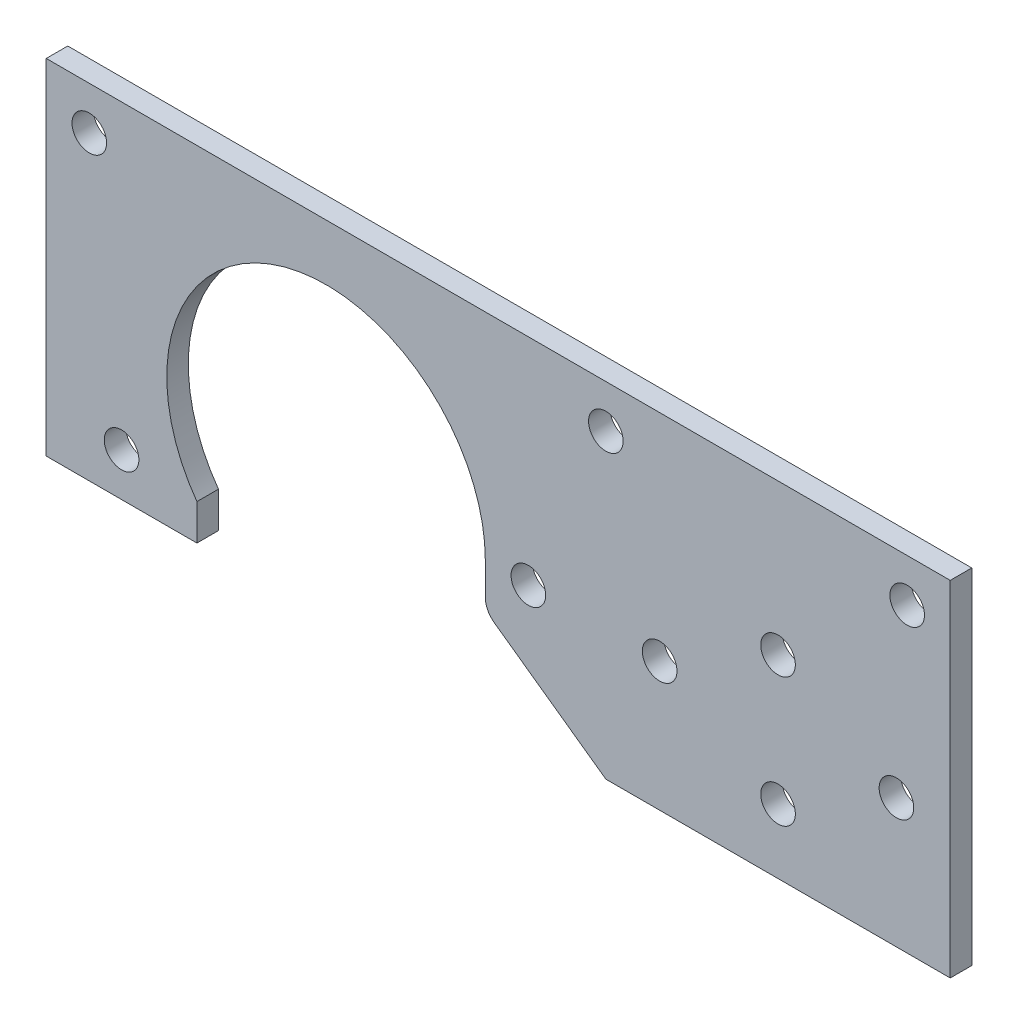
ISO-10303-21;
HEADER;
FILE_DESCRIPTION(('STEP AP214'),'2;1');
FILE_NAME('part.step','',(''),(''),'','','');
FILE_SCHEMA(('AUTOMOTIVE_DESIGN { 1 0 10303 214 1 1 1 1 }'));
ENDSEC;
DATA;
#1=APPLICATION_CONTEXT('core data for automotive mechanical design processes');
#2=APPLICATION_PROTOCOL_DEFINITION('international standard','automotive_design',2000,#1);
#3=PRODUCT_CONTEXT('',#1,'mechanical');
#4=PRODUCT('Part','Part','',(#3));
#5=PRODUCT_RELATED_PRODUCT_CATEGORY('part','',(#4));
#6=PRODUCT_DEFINITION_FORMATION('','',#4);
#7=PRODUCT_DEFINITION_CONTEXT('part definition',#1,'design');
#8=PRODUCT_DEFINITION('design','',#6,#7);
#9=PRODUCT_DEFINITION_SHAPE('','',#8);
#10=(LENGTH_UNIT() NAMED_UNIT(*) SI_UNIT(.MILLI.,.METRE.));
#11=(NAMED_UNIT(*) PLANE_ANGLE_UNIT() SI_UNIT($,.RADIAN.));
#12=(NAMED_UNIT(*) SI_UNIT($,.STERADIAN.) SOLID_ANGLE_UNIT());
#13=UNCERTAINTY_MEASURE_WITH_UNIT(LENGTH_MEASURE(1.E-05),#10,'distance_accuracy_value','');
#14=(GEOMETRIC_REPRESENTATION_CONTEXT(3) GLOBAL_UNCERTAINTY_ASSIGNED_CONTEXT((#13)) GLOBAL_UNIT_ASSIGNED_CONTEXT((#10,
#11,#12)) REPRESENTATION_CONTEXT('',''));
#15=CARTESIAN_POINT('',(0.,0.,0.));
#16=DIRECTION('',(0.,0.,1.));
#17=DIRECTION('',(1.,0.,0.));
#18=AXIS2_PLACEMENT_3D('',#15,#16,#17);
#19=CARTESIAN_POINT('',(-92.0749999999989,19.05,3.175));
#20=DIRECTION('',(0.,0.,-1.));
#21=DIRECTION('',(-1.,0.,0.));
#22=AXIS2_PLACEMENT_3D('',#19,#20,#21);
#23=PLANE('',#22);
#24=CARTESIAN_POINT('',(-122.2375,6.35,3.175));
#25=DIRECTION('',(0.,0.,-1.));
#26=DIRECTION('',(-1.,0.,0.));
#27=AXIS2_PLACEMENT_3D('',#24,#25,#26);
#28=CIRCLE('',#27,2.55269999999998);
#29=CARTESIAN_POINT('',(-124.7902,6.35,3.175));
#30=VERTEX_POINT('',#29);
#31=EDGE_CURVE('E215',#30,#30,#28,.T.);
#32=ORIENTED_EDGE('',*,*,#31,.T.);
#33=EDGE_LOOP('',(#32));
#34=FACE_BOUND('',#33,.T.);
#35=CARTESIAN_POINT('',(-62.2299999999989,19.05,3.175));
#36=DIRECTION('',(0.,0.,-1.));
#37=DIRECTION('',(-1.,0.,0.));
#38=AXIS2_PLACEMENT_3D('',#35,#36,#37);
#39=CIRCLE('',#38,2.55270000000002);
#40=CARTESIAN_POINT('',(-64.7826999999989,19.05,3.175));
#41=VERTEX_POINT('',#40);
#42=EDGE_CURVE('E232',#41,#41,#39,.T.);
#43=ORIENTED_EDGE('',*,*,#42,.T.);
#44=EDGE_LOOP('',(#43));
#45=FACE_BOUND('',#44,.T.);
#46=CARTESIAN_POINT('',(-50.8,44.45,3.175));
#47=DIRECTION('',(0.,0.,-1.));
#48=DIRECTION('',(-1.,0.,0.));
#49=AXIS2_PLACEMENT_3D('',#46,#47,#48);
#50=CIRCLE('',#49,2.5527);
#51=CARTESIAN_POINT('',(-53.3527,44.45,3.175));
#52=VERTEX_POINT('',#51);
#53=EDGE_CURVE('E238',#52,#52,#50,.T.);
#54=ORIENTED_EDGE('',*,*,#53,.T.);
#55=EDGE_LOOP('',(#54));
#56=FACE_BOUND('',#55,.T.);
#57=CARTESIAN_POINT('',(-6.35,44.45,3.175));
#58=DIRECTION('',(0.,0.,-1.));
#59=DIRECTION('',(-1.,0.,0.));
#60=AXIS2_PLACEMENT_3D('',#57,#58,#59);
#61=CIRCLE('',#60,2.5527);
#62=CARTESIAN_POINT('',(-8.9027,44.45,3.175));
#63=VERTEX_POINT('',#62);
#64=EDGE_CURVE('E218',#63,#63,#61,.T.);
#65=ORIENTED_EDGE('',*,*,#64,.T.);
#66=EDGE_LOOP('',(#65));
#67=FACE_BOUND('',#66,.T.);
#68=CARTESIAN_POINT('',(-127.,44.45,3.175));
#69=DIRECTION('',(0.,0.,-1.));
#70=DIRECTION('',(-1.,0.,0.));
#71=AXIS2_PLACEMENT_3D('',#68,#69,#70);
#72=CIRCLE('',#71,2.55269999999998);
#73=CARTESIAN_POINT('',(-129.5527,44.45,3.175));
#74=VERTEX_POINT('',#73);
#75=EDGE_CURVE('E225',#74,#74,#72,.T.);
#76=ORIENTED_EDGE('',*,*,#75,.T.);
#77=EDGE_LOOP('',(#76));
#78=FACE_BOUND('',#77,.T.);
#79=DIRECTION('',(0.,-1.,0.));
#80=VECTOR('',#79,1.);
#81=CARTESIAN_POINT('',(-68.5799999999989,19.05,3.175));
#82=LINE('',#81,#80);
#83=CARTESIAN_POINT('',(-68.5799999999989,19.05,3.175));
#84=VERTEX_POINT('',#83);
#85=CARTESIAN_POINT('',(-68.5799999999989,14.3339118175514,3.175));
#86=VERTEX_POINT('',#85);
#87=EDGE_CURVE('E187',#84,#86,#82,.T.);
#88=ORIENTED_EDGE('',*,*,#87,.T.);
#89=CARTESIAN_POINT('',(-65.4049999999989,14.3339118175514,3.175));
#90=DIRECTION('',(0.,0.,-1.));
#91=DIRECTION('',(-1.,0.,0.));
#92=AXIS2_PLACEMENT_3D('',#89,#90,#91);
#93=CIRCLE('',#92,3.175);
#94=CARTESIAN_POINT('',(-67.2504312650571,11.7503080464701,3.175));
#95=VERTEX_POINT('',#94);
#96=EDGE_CURVE('E11',#86,#95,#93,.F.);
#97=ORIENTED_EDGE('',*,*,#96,.T.);
#98=DIRECTION('',(0.813733471206719,-0.581238193719119,0.));
#99=VECTOR('',#98,1.);
#100=CARTESIAN_POINT('',(-68.5799999999989,12.7,3.175));
#101=LINE('',#100,#99);
#102=CARTESIAN_POINT('',(-50.8,0.,3.175));
#103=VERTEX_POINT('',#102);
#104=EDGE_CURVE('E185',#95,#103,#101,.T.);
#105=ORIENTED_EDGE('',*,*,#104,.T.);
#106=DIRECTION('',(1.,0.,0.));
#107=VECTOR('',#106,1.);
#108=CARTESIAN_POINT('',(-50.8,0.,3.175));
#109=LINE('',#108,#107);
#110=CARTESIAN_POINT('',(0.,0.,3.175));
#111=VERTEX_POINT('',#110);
#112=EDGE_CURVE('E183',#103,#111,#109,.T.);
#113=ORIENTED_EDGE('',*,*,#112,.T.);
#114=DIRECTION('',(0.,1.,0.));
#115=VECTOR('',#114,1.);
#116=CARTESIAN_POINT('',(0.,0.,3.175));
#117=LINE('',#116,#115);
#118=CARTESIAN_POINT('',(0.,50.8,3.175));
#119=VERTEX_POINT('',#118);
#120=EDGE_CURVE('E132',#111,#119,#117,.T.);
#121=ORIENTED_EDGE('',*,*,#120,.T.);
#122=DIRECTION('',(-1.,0.,0.));
#123=VECTOR('',#122,1.);
#124=CARTESIAN_POINT('',(0.,50.8,3.175));
#125=LINE('',#124,#123);
#126=CARTESIAN_POINT('',(-133.35,50.8,3.175));
#127=VERTEX_POINT('',#126);
#128=EDGE_CURVE('E127',#119,#127,#125,.T.);
#129=ORIENTED_EDGE('',*,*,#128,.T.);
#130=DIRECTION('',(0.,-1.,0.));
#131=VECTOR('',#130,1.);
#132=CARTESIAN_POINT('',(-133.35,50.8,3.175));
#133=LINE('',#132,#131);
#134=CARTESIAN_POINT('',(-133.35,0.,3.175));
#135=VERTEX_POINT('',#134);
#136=EDGE_CURVE('E116',#127,#135,#133,.T.);
#137=ORIENTED_EDGE('',*,*,#136,.T.);
#138=DIRECTION('',(1.,0.,0.));
#139=VECTOR('',#138,1.);
#140=CARTESIAN_POINT('',(-133.35,0.,3.175));
#141=LINE('',#140,#139);
#142=CARTESIAN_POINT('',(-111.125,0.,3.175));
#143=VERTEX_POINT('',#142);
#144=EDGE_CURVE('E126',#135,#143,#141,.T.);
#145=ORIENTED_EDGE('',*,*,#144,.T.);
#146=DIRECTION('',(0.,1.,0.));
#147=VECTOR('',#146,1.);
#148=CARTESIAN_POINT('',(-111.125,0.,3.175));
#149=LINE('',#148,#147);
#150=CARTESIAN_POINT('',(-111.125,5.29818102940709,3.175));
#151=VERTEX_POINT('',#150);
#152=EDGE_CURVE('E191',#143,#151,#149,.T.);
#153=ORIENTED_EDGE('',*,*,#152,.T.);
#154=CARTESIAN_POINT('',(-92.0749999999989,19.05,3.175));
#155=DIRECTION('',(0.,0.,-1.));
#156=DIRECTION('',(-1.,0.,0.));
#157=AXIS2_PLACEMENT_3D('',#154,#155,#156);
#158=CIRCLE('',#157,23.495);
#159=EDGE_CURVE('E189',#151,#84,#158,.T.);
#160=ORIENTED_EDGE('',*,*,#159,.T.);
#161=EDGE_LOOP('',(#88,#97,#105,#113,#121,#129,#137,#145,#153,#160));
#162=FACE_BOUND('',#161,.T.);
#163=CARTESIAN_POINT('',(-25.4,9.525,3.175));
#164=DIRECTION('',(0.,0.,1.));
#165=DIRECTION('',(1.,0.,0.));
#166=AXIS2_PLACEMENT_3D('',#163,#164,#165);
#167=CIRCLE('',#166,2.5527);
#168=CARTESIAN_POINT('',(-22.8473,9.525,3.175));
#169=VERTEX_POINT('',#168);
#170=EDGE_CURVE('E181',#169,#169,#167,.T.);
#171=ORIENTED_EDGE('',*,*,#170,.F.);
#172=EDGE_LOOP('',(#171));
#173=FACE_BOUND('',#172,.T.);
#174=CARTESIAN_POINT('',(-25.4,28.575,3.175));
#175=DIRECTION('',(0.,0.,1.));
#176=DIRECTION('',(1.,0.,0.));
#177=AXIS2_PLACEMENT_3D('',#174,#175,#176);
#178=CIRCLE('',#177,2.5527);
#179=CARTESIAN_POINT('',(-22.8473,28.575,3.175));
#180=VERTEX_POINT('',#179);
#181=EDGE_CURVE('E197',#180,#180,#178,.T.);
#182=ORIENTED_EDGE('',*,*,#181,.F.);
#183=EDGE_LOOP('',(#182));
#184=FACE_BOUND('',#183,.T.);
#185=CARTESIAN_POINT('',(-7.9375,19.05,3.175));
#186=DIRECTION('',(0.,0.,1.));
#187=DIRECTION('',(1.,0.,0.));
#188=AXIS2_PLACEMENT_3D('',#185,#186,#187);
#189=CIRCLE('',#188,2.5527);
#190=CARTESIAN_POINT('',(-5.3848,19.05,3.175));
#191=VERTEX_POINT('',#190);
#192=EDGE_CURVE('E203',#191,#191,#189,.T.);
#193=ORIENTED_EDGE('',*,*,#192,.F.);
#194=EDGE_LOOP('',(#193));
#195=FACE_BOUND('',#194,.T.);
#196=CARTESIAN_POINT('',(-42.8625,19.05,3.175));
#197=DIRECTION('',(0.,0.,1.));
#198=DIRECTION('',(1.,0.,0.));
#199=AXIS2_PLACEMENT_3D('',#196,#197,#198);
#200=CIRCLE('',#199,2.5527);
#201=CARTESIAN_POINT('',(-40.3098,19.05,3.175));
#202=VERTEX_POINT('',#201);
#203=EDGE_CURVE('E209',#202,#202,#200,.T.);
#204=ORIENTED_EDGE('',*,*,#203,.F.);
#205=EDGE_LOOP('',(#204));
#206=FACE_BOUND('',#205,.T.);
#207=ADVANCED_FACE('F39',(#34,#45,#56,#67,#78,#162,#173,#184,#195,#206),#23,.F.);
#208=CARTESIAN_POINT('',(-92.0749999999989,19.05,0.));
#209=DIRECTION('',(0.,0.,-1.));
#210=DIRECTION('',(-1.,0.,0.));
#211=AXIS2_PLACEMENT_3D('',#208,#209,#210);
#212=PLANE('',#211);
#213=CARTESIAN_POINT('',(-122.2375,6.35,0.));
#214=DIRECTION('',(0.,0.,-1.));
#215=DIRECTION('',(-1.,0.,0.));
#216=AXIS2_PLACEMENT_3D('',#213,#214,#215);
#217=CIRCLE('',#216,2.55269999999998);
#218=CARTESIAN_POINT('',(-124.7902,6.35,0.));
#219=VERTEX_POINT('',#218);
#220=EDGE_CURVE('E231',#219,#219,#217,.T.);
#221=ORIENTED_EDGE('',*,*,#220,.F.);
#222=EDGE_LOOP('',(#221));
#223=FACE_BOUND('',#222,.T.);
#224=CARTESIAN_POINT('',(-62.2299999999989,19.05,0.));
#225=DIRECTION('',(0.,0.,-1.));
#226=DIRECTION('',(-1.,0.,0.));
#227=AXIS2_PLACEMENT_3D('',#224,#225,#226);
#228=CIRCLE('',#227,2.55270000000002);
#229=CARTESIAN_POINT('',(-64.7826999999989,19.05,0.));
#230=VERTEX_POINT('',#229);
#231=EDGE_CURVE('E235',#230,#230,#228,.T.);
#232=ORIENTED_EDGE('',*,*,#231,.F.);
#233=EDGE_LOOP('',(#232));
#234=FACE_BOUND('',#233,.T.);
#235=CARTESIAN_POINT('',(-50.8,44.45,0.));
#236=DIRECTION('',(0.,0.,-1.));
#237=DIRECTION('',(-1.,0.,0.));
#238=AXIS2_PLACEMENT_3D('',#235,#236,#237);
#239=CIRCLE('',#238,2.5527);
#240=CARTESIAN_POINT('',(-53.3527,44.45,0.));
#241=VERTEX_POINT('',#240);
#242=EDGE_CURVE('E222',#241,#241,#239,.T.);
#243=ORIENTED_EDGE('',*,*,#242,.F.);
#244=EDGE_LOOP('',(#243));
#245=FACE_BOUND('',#244,.T.);
#246=CARTESIAN_POINT('',(-6.35,44.45,0.));
#247=DIRECTION('',(0.,0.,-1.));
#248=DIRECTION('',(-1.,0.,0.));
#249=AXIS2_PLACEMENT_3D('',#246,#247,#248);
#250=CIRCLE('',#249,2.5527);
#251=CARTESIAN_POINT('',(-8.9027,44.45,0.));
#252=VERTEX_POINT('',#251);
#253=EDGE_CURVE('E221',#252,#252,#250,.T.);
#254=ORIENTED_EDGE('',*,*,#253,.F.);
#255=EDGE_LOOP('',(#254));
#256=FACE_BOUND('',#255,.T.);
#257=CARTESIAN_POINT('',(-127.,44.45,0.));
#258=DIRECTION('',(0.,0.,-1.));
#259=DIRECTION('',(-1.,0.,0.));
#260=AXIS2_PLACEMENT_3D('',#257,#258,#259);
#261=CIRCLE('',#260,2.55269999999998);
#262=CARTESIAN_POINT('',(-129.5527,44.45,0.));
#263=VERTEX_POINT('',#262);
#264=EDGE_CURVE('E228',#263,#263,#261,.T.);
#265=ORIENTED_EDGE('',*,*,#264,.F.);
#266=EDGE_LOOP('',(#265));
#267=FACE_BOUND('',#266,.T.);
#268=CARTESIAN_POINT('',(-7.9375,19.05,0.));
#269=DIRECTION('',(0.,0.,1.));
#270=DIRECTION('',(1.,0.,0.));
#271=AXIS2_PLACEMENT_3D('',#268,#269,#270);
#272=CIRCLE('',#271,2.5527);
#273=CARTESIAN_POINT('',(-5.3848,19.05,0.));
#274=VERTEX_POINT('',#273);
#275=EDGE_CURVE('E206',#274,#274,#272,.T.);
#276=ORIENTED_EDGE('',*,*,#275,.T.);
#277=EDGE_LOOP('',(#276));
#278=FACE_BOUND('',#277,.T.);
#279=CARTESIAN_POINT('',(-25.4,9.525,0.));
#280=DIRECTION('',(0.,0.,1.));
#281=DIRECTION('',(1.,0.,0.));
#282=AXIS2_PLACEMENT_3D('',#279,#280,#281);
#283=CIRCLE('',#282,2.5527);
#284=CARTESIAN_POINT('',(-22.8473,9.525,0.));
#285=VERTEX_POINT('',#284);
#286=EDGE_CURVE('E194',#285,#285,#283,.T.);
#287=ORIENTED_EDGE('',*,*,#286,.T.);
#288=EDGE_LOOP('',(#287));
#289=FACE_BOUND('',#288,.T.);
#290=DIRECTION('',(0.813733471206719,-0.581238193719119,0.));
#291=VECTOR('',#290,1.);
#292=CARTESIAN_POINT('',(-68.5799999999989,12.7,0.));
#293=LINE('',#292,#291);
#294=CARTESIAN_POINT('',(-67.2504312650571,11.7503080464701,0.));
#295=VERTEX_POINT('',#294);
#296=CARTESIAN_POINT('',(-50.8,0.,0.));
#297=VERTEX_POINT('',#296);
#298=EDGE_CURVE('E168',#295,#297,#293,.T.);
#299=ORIENTED_EDGE('',*,*,#298,.F.);
#300=CARTESIAN_POINT('',(-65.4049999999989,14.3339118175514,0.));
#301=DIRECTION('',(0.,0.,-1.));
#302=DIRECTION('',(-1.,0.,0.));
#303=AXIS2_PLACEMENT_3D('',#300,#301,#302);
#304=CIRCLE('',#303,3.175);
#305=CARTESIAN_POINT('',(-68.5799999999989,14.3339118175514,0.));
#306=VERTEX_POINT('',#305);
#307=EDGE_CURVE('E61',#295,#306,#304,.T.);
#308=ORIENTED_EDGE('',*,*,#307,.T.);
#309=DIRECTION('',(0.,-1.,0.));
#310=VECTOR('',#309,1.);
#311=CARTESIAN_POINT('',(-68.5799999999989,19.05,0.));
#312=LINE('',#311,#310);
#313=CARTESIAN_POINT('',(-68.5799999999989,19.05,0.));
#314=VERTEX_POINT('',#313);
#315=EDGE_CURVE('E170',#314,#306,#312,.T.);
#316=ORIENTED_EDGE('',*,*,#315,.F.);
#317=CARTESIAN_POINT('',(-92.0749999999989,19.05,0.));
#318=DIRECTION('',(0.,0.,-1.));
#319=DIRECTION('',(-1.,0.,0.));
#320=AXIS2_PLACEMENT_3D('',#317,#318,#319);
#321=CIRCLE('',#320,23.495);
#322=CARTESIAN_POINT('',(-111.125,5.29818102940709,0.));
#323=VERTEX_POINT('',#322);
#324=EDGE_CURVE('E172',#323,#314,#321,.T.);
#325=ORIENTED_EDGE('',*,*,#324,.F.);
#326=DIRECTION('',(0.,1.,0.));
#327=VECTOR('',#326,1.);
#328=CARTESIAN_POINT('',(-111.125,0.,0.));
#329=LINE('',#328,#327);
#330=CARTESIAN_POINT('',(-111.125,0.,0.));
#331=VERTEX_POINT('',#330);
#332=EDGE_CURVE('E174',#331,#323,#329,.T.);
#333=ORIENTED_EDGE('',*,*,#332,.F.);
#334=DIRECTION('',(1.,0.,0.));
#335=VECTOR('',#334,1.);
#336=CARTESIAN_POINT('',(-133.35,0.,0.));
#337=LINE('',#336,#335);
#338=CARTESIAN_POINT('',(-133.35,0.,0.));
#339=VERTEX_POINT('',#338);
#340=EDGE_CURVE('E176',#339,#331,#337,.T.);
#341=ORIENTED_EDGE('',*,*,#340,.F.);
#342=DIRECTION('',(0.,-1.,0.));
#343=VECTOR('',#342,1.);
#344=CARTESIAN_POINT('',(-133.35,50.8,0.));
#345=LINE('',#344,#343);
#346=CARTESIAN_POINT('',(-133.35,50.8,0.));
#347=VERTEX_POINT('',#346);
#348=EDGE_CURVE('E178',#347,#339,#345,.T.);
#349=ORIENTED_EDGE('',*,*,#348,.F.);
#350=DIRECTION('',(-1.,0.,0.));
#351=VECTOR('',#350,1.);
#352=CARTESIAN_POINT('',(0.,50.8,0.));
#353=LINE('',#352,#351);
#354=CARTESIAN_POINT('',(0.,50.8,0.));
#355=VERTEX_POINT('',#354);
#356=EDGE_CURVE('E140',#355,#347,#353,.T.);
#357=ORIENTED_EDGE('',*,*,#356,.F.);
#358=DIRECTION('',(0.,1.,0.));
#359=VECTOR('',#358,1.);
#360=CARTESIAN_POINT('',(0.,0.,0.));
#361=LINE('',#360,#359);
#362=CARTESIAN_POINT('',(0.,0.,0.));
#363=VERTEX_POINT('',#362);
#364=EDGE_CURVE('E136',#363,#355,#361,.T.);
#365=ORIENTED_EDGE('',*,*,#364,.F.);
#366=DIRECTION('',(1.,0.,0.));
#367=VECTOR('',#366,1.);
#368=CARTESIAN_POINT('',(-50.8,0.,0.));
#369=LINE('',#368,#367);
#370=EDGE_CURVE('E166',#297,#363,#369,.T.);
#371=ORIENTED_EDGE('',*,*,#370,.F.);
#372=EDGE_LOOP('',(#299,#308,#316,#325,#333,#341,#349,#357,#365,#371));
#373=FACE_BOUND('',#372,.T.);
#374=CARTESIAN_POINT('',(-25.4,28.575,0.));
#375=DIRECTION('',(0.,0.,1.));
#376=DIRECTION('',(1.,0.,0.));
#377=AXIS2_PLACEMENT_3D('',#374,#375,#376);
#378=CIRCLE('',#377,2.5527);
#379=CARTESIAN_POINT('',(-22.8473,28.575,0.));
#380=VERTEX_POINT('',#379);
#381=EDGE_CURVE('E200',#380,#380,#378,.T.);
#382=ORIENTED_EDGE('',*,*,#381,.T.);
#383=EDGE_LOOP('',(#382));
#384=FACE_BOUND('',#383,.T.);
#385=CARTESIAN_POINT('',(-42.8625,19.05,0.));
#386=DIRECTION('',(0.,0.,1.));
#387=DIRECTION('',(1.,0.,0.));
#388=AXIS2_PLACEMENT_3D('',#385,#386,#387);
#389=CIRCLE('',#388,2.5527);
#390=CARTESIAN_POINT('',(-40.3098,19.05,0.));
#391=VERTEX_POINT('',#390);
#392=EDGE_CURVE('E212',#391,#391,#389,.T.);
#393=ORIENTED_EDGE('',*,*,#392,.T.);
#394=EDGE_LOOP('',(#393));
#395=FACE_BOUND('',#394,.T.);
#396=ADVANCED_FACE('F257',(#223,#234,#245,#256,#267,#278,#289,#373,#384,#395),#212,.T.);
#397=CARTESIAN_POINT('',(0.,50.8,3.175));
#398=DIRECTION('',(0.,-1.,0.));
#399=DIRECTION('',(1.,0.,0.));
#400=AXIS2_PLACEMENT_3D('',#397,#398,#399);
#401=PLANE('',#400);
#402=ORIENTED_EDGE('',*,*,#356,.T.);
#403=DIRECTION('',(0.,0.,-1.));
#404=VECTOR('',#403,1.);
#405=CARTESIAN_POINT('',(-133.35,50.8,3.175));
#406=LINE('',#405,#404);
#407=EDGE_CURVE('E120',#127,#347,#406,.T.);
#408=ORIENTED_EDGE('',*,*,#407,.F.);
#409=ORIENTED_EDGE('',*,*,#128,.F.);
#410=DIRECTION('',(0.,0.,-1.));
#411=VECTOR('',#410,1.);
#412=CARTESIAN_POINT('',(0.,50.8,3.175));
#413=LINE('',#412,#411);
#414=EDGE_CURVE('E163',#119,#355,#413,.T.);
#415=ORIENTED_EDGE('',*,*,#414,.T.);
#416=EDGE_LOOP('',(#402,#408,#409,#415));
#417=FACE_BOUND('',#416,.T.);
#418=ADVANCED_FACE('F138',(#417),#401,.F.);
#419=CARTESIAN_POINT('',(-133.35,50.8,3.175));
#420=DIRECTION('',(1.,0.,0.));
#421=DIRECTION('',(0.,0.,-1.));
#422=AXIS2_PLACEMENT_3D('',#419,#420,#421);
#423=PLANE('',#422);
#424=ORIENTED_EDGE('',*,*,#348,.T.);
#425=DIRECTION('',(0.,0.,-1.));
#426=VECTOR('',#425,1.);
#427=CARTESIAN_POINT('',(-133.35,0.,3.175));
#428=LINE('',#427,#426);
#429=EDGE_CURVE('E123',#135,#339,#428,.T.);
#430=ORIENTED_EDGE('',*,*,#429,.F.);
#431=ORIENTED_EDGE('',*,*,#136,.F.);
#432=ORIENTED_EDGE('',*,*,#407,.T.);
#433=EDGE_LOOP('',(#424,#430,#431,#432));
#434=FACE_BOUND('',#433,.T.);
#435=ADVANCED_FACE('F118',(#434),#423,.F.);
#436=CARTESIAN_POINT('',(-133.35,0.,3.175));
#437=DIRECTION('',(0.,1.,0.));
#438=DIRECTION('',(0.,0.,1.));
#439=AXIS2_PLACEMENT_3D('',#436,#437,#438);
#440=PLANE('',#439);
#441=ORIENTED_EDGE('',*,*,#340,.T.);
#442=DIRECTION('',(0.,0.,-1.));
#443=VECTOR('',#442,1.);
#444=CARTESIAN_POINT('',(-111.125,0.,3.175));
#445=LINE('',#444,#443);
#446=EDGE_CURVE('E145',#143,#331,#445,.T.);
#447=ORIENTED_EDGE('',*,*,#446,.F.);
#448=ORIENTED_EDGE('',*,*,#144,.F.);
#449=ORIENTED_EDGE('',*,*,#429,.T.);
#450=EDGE_LOOP('',(#441,#447,#448,#449));
#451=FACE_BOUND('',#450,.T.);
#452=ADVANCED_FACE('F325',(#451),#440,.F.);
#453=CARTESIAN_POINT('',(-111.125,0.,3.175));
#454=DIRECTION('',(-1.,0.,0.));
#455=DIRECTION('',(0.,0.,1.));
#456=AXIS2_PLACEMENT_3D('',#453,#454,#455);
#457=PLANE('',#456);
#458=ORIENTED_EDGE('',*,*,#332,.T.);
#459=DIRECTION('',(0.,0.,-1.));
#460=VECTOR('',#459,1.);
#461=CARTESIAN_POINT('',(-111.125,5.29818102940709,3.175));
#462=LINE('',#461,#460);
#463=EDGE_CURVE('E151',#151,#323,#462,.T.);
#464=ORIENTED_EDGE('',*,*,#463,.F.);
#465=ORIENTED_EDGE('',*,*,#152,.F.);
#466=ORIENTED_EDGE('',*,*,#446,.T.);
#467=EDGE_LOOP('',(#458,#464,#465,#466));
#468=FACE_BOUND('',#467,.T.);
#469=ADVANCED_FACE('F321',(#468),#457,.F.);
#470=CARTESIAN_POINT('',(-92.0749999999989,19.05,3.175));
#471=DIRECTION('',(0.,0.,-1.));
#472=DIRECTION('',(-1.,0.,0.));
#473=AXIS2_PLACEMENT_3D('',#470,#471,#472);
#474=CYLINDRICAL_SURFACE('',#473,23.495);
#475=ORIENTED_EDGE('',*,*,#324,.T.);
#476=DIRECTION('',(0.,0.,-1.));
#477=VECTOR('',#476,1.);
#478=CARTESIAN_POINT('',(-68.5799999999989,19.05,3.175));
#479=LINE('',#478,#477);
#480=EDGE_CURVE('E154',#84,#314,#479,.T.);
#481=ORIENTED_EDGE('',*,*,#480,.F.);
#482=ORIENTED_EDGE('',*,*,#159,.F.);
#483=ORIENTED_EDGE('',*,*,#463,.T.);
#484=EDGE_LOOP('',(#475,#481,#482,#483));
#485=FACE_BOUND('',#484,.T.);
#486=ADVANCED_FACE('F318',(#485),#474,.F.);
#487=CARTESIAN_POINT('',(-68.5799999999989,19.05,3.175));
#488=DIRECTION('',(1.,0.,0.));
#489=DIRECTION('',(0.,0.,-1.));
#490=AXIS2_PLACEMENT_3D('',#487,#488,#489);
#491=PLANE('',#490);
#492=ORIENTED_EDGE('',*,*,#315,.T.);
#493=DIRECTION('',(0.,0.,-1.));
#494=VECTOR('',#493,1.);
#495=CARTESIAN_POINT('',(-68.5799999999989,14.3339118175514,3.175));
#496=LINE('',#495,#494);
#497=EDGE_CURVE('E47',#306,#86,#496,.F.);
#498=ORIENTED_EDGE('',*,*,#497,.T.);
#499=ORIENTED_EDGE('',*,*,#87,.F.);
#500=ORIENTED_EDGE('',*,*,#480,.T.);
#501=EDGE_LOOP('',(#492,#498,#499,#500));
#502=FACE_BOUND('',#501,.T.);
#503=ADVANCED_FACE('F314',(#502),#491,.F.);
#504=CARTESIAN_POINT('',(-68.5799999999989,12.7,3.175));
#505=DIRECTION('',(0.581238193719119,0.813733471206718,0.));
#506=DIRECTION('',(-0.813733471206719,0.581238193719119,0.));
#507=AXIS2_PLACEMENT_3D('',#504,#505,#506);
#508=PLANE('',#507);
#509=ORIENTED_EDGE('',*,*,#104,.F.);
#510=DIRECTION('',(0.,0.,-1.));
#511=VECTOR('',#510,1.);
#512=CARTESIAN_POINT('',(-67.2504312650571,11.7503080464701,3.175));
#513=LINE('',#512,#511);
#514=EDGE_CURVE('E141',#95,#295,#513,.T.);
#515=ORIENTED_EDGE('',*,*,#514,.T.);
#516=ORIENTED_EDGE('',*,*,#298,.T.);
#517=DIRECTION('',(0.,0.,-1.));
#518=VECTOR('',#517,1.);
#519=CARTESIAN_POINT('',(-50.8,0.,3.175));
#520=LINE('',#519,#518);
#521=EDGE_CURVE('E157',#103,#297,#520,.T.);
#522=ORIENTED_EDGE('',*,*,#521,.F.);
#523=EDGE_LOOP('',(#509,#515,#516,#522));
#524=FACE_BOUND('',#523,.T.);
#525=ADVANCED_FACE('F310',(#524),#508,.F.);
#526=CARTESIAN_POINT('',(-50.8,0.,3.175));
#527=DIRECTION('',(0.,1.,0.));
#528=DIRECTION('',(0.,0.,1.));
#529=AXIS2_PLACEMENT_3D('',#526,#527,#528);
#530=PLANE('',#529);
#531=ORIENTED_EDGE('',*,*,#370,.T.);
#532=DIRECTION('',(0.,0.,-1.));
#533=VECTOR('',#532,1.);
#534=CARTESIAN_POINT('',(0.,0.,3.175));
#535=LINE('',#534,#533);
#536=EDGE_CURVE('E160',#111,#363,#535,.T.);
#537=ORIENTED_EDGE('',*,*,#536,.F.);
#538=ORIENTED_EDGE('',*,*,#112,.F.);
#539=ORIENTED_EDGE('',*,*,#521,.T.);
#540=EDGE_LOOP('',(#531,#537,#538,#539));
#541=FACE_BOUND('',#540,.T.);
#542=ADVANCED_FACE('F306',(#541),#530,.F.);
#543=CARTESIAN_POINT('',(0.,0.,3.175));
#544=DIRECTION('',(-1.,0.,0.));
#545=DIRECTION('',(0.,0.,1.));
#546=AXIS2_PLACEMENT_3D('',#543,#544,#545);
#547=PLANE('',#546);
#548=ORIENTED_EDGE('',*,*,#364,.T.);
#549=ORIENTED_EDGE('',*,*,#414,.F.);
#550=ORIENTED_EDGE('',*,*,#120,.F.);
#551=ORIENTED_EDGE('',*,*,#536,.T.);
#552=EDGE_LOOP('',(#548,#549,#550,#551));
#553=FACE_BOUND('',#552,.T.);
#554=ADVANCED_FACE('F303',(#553),#547,.F.);
#555=CARTESIAN_POINT('',(-25.4,9.525,3.175));
#556=DIRECTION('',(0.,0.,-1.));
#557=DIRECTION('',(-1.,0.,0.));
#558=AXIS2_PLACEMENT_3D('',#555,#556,#557);
#559=CYLINDRICAL_SURFACE('',#558,2.5527);
#560=ORIENTED_EDGE('',*,*,#170,.T.);
#561=EDGE_LOOP('',(#560));
#562=FACE_BOUND('',#561,.T.);
#563=ORIENTED_EDGE('',*,*,#286,.F.);
#564=EDGE_LOOP('',(#563));
#565=FACE_BOUND('',#564,.T.);
#566=ADVANCED_FACE('F300',(#562,#565),#559,.F.);
#567=CARTESIAN_POINT('',(-25.4,28.575,3.175));
#568=DIRECTION('',(0.,0.,-1.));
#569=DIRECTION('',(-1.,0.,0.));
#570=AXIS2_PLACEMENT_3D('',#567,#568,#569);
#571=CYLINDRICAL_SURFACE('',#570,2.5527);
#572=ORIENTED_EDGE('',*,*,#181,.T.);
#573=EDGE_LOOP('',(#572));
#574=FACE_BOUND('',#573,.T.);
#575=ORIENTED_EDGE('',*,*,#381,.F.);
#576=EDGE_LOOP('',(#575));
#577=FACE_BOUND('',#576,.T.);
#578=ADVANCED_FACE('F291',(#574,#577),#571,.F.);
#579=CARTESIAN_POINT('',(-7.9375,19.05,3.175));
#580=DIRECTION('',(0.,0.,-1.));
#581=DIRECTION('',(-1.,0.,0.));
#582=AXIS2_PLACEMENT_3D('',#579,#580,#581);
#583=CYLINDRICAL_SURFACE('',#582,2.5527);
#584=ORIENTED_EDGE('',*,*,#192,.T.);
#585=EDGE_LOOP('',(#584));
#586=FACE_BOUND('',#585,.T.);
#587=ORIENTED_EDGE('',*,*,#275,.F.);
#588=EDGE_LOOP('',(#587));
#589=FACE_BOUND('',#588,.T.);
#590=ADVANCED_FACE('F281',(#586,#589),#583,.F.);
#591=CARTESIAN_POINT('',(-42.8625,19.05,3.175));
#592=DIRECTION('',(0.,0.,-1.));
#593=DIRECTION('',(-1.,0.,0.));
#594=AXIS2_PLACEMENT_3D('',#591,#592,#593);
#595=CYLINDRICAL_SURFACE('',#594,2.5527);
#596=ORIENTED_EDGE('',*,*,#203,.T.);
#597=EDGE_LOOP('',(#596));
#598=FACE_BOUND('',#597,.T.);
#599=ORIENTED_EDGE('',*,*,#392,.F.);
#600=EDGE_LOOP('',(#599));
#601=FACE_BOUND('',#600,.T.);
#602=ADVANCED_FACE('F278',(#598,#601),#595,.F.);
#603=CARTESIAN_POINT('',(-127.,44.45,3.175));
#604=DIRECTION('',(0.,0.,-1.));
#605=DIRECTION('',(-1.,0.,0.));
#606=AXIS2_PLACEMENT_3D('',#603,#604,#605);
#607=CYLINDRICAL_SURFACE('',#606,2.55269999999998);
#608=ORIENTED_EDGE('',*,*,#75,.F.);
#609=EDGE_LOOP('',(#608));
#610=FACE_BOUND('',#609,.T.);
#611=ORIENTED_EDGE('',*,*,#264,.T.);
#612=EDGE_LOOP('',(#611));
#613=FACE_BOUND('',#612,.T.);
#614=ADVANCED_FACE('F280',(#610,#613),#607,.F.);
#615=CARTESIAN_POINT('',(-6.35,44.45,3.175));
#616=DIRECTION('',(0.,0.,-1.));
#617=DIRECTION('',(-1.,0.,0.));
#618=AXIS2_PLACEMENT_3D('',#615,#616,#617);
#619=CYLINDRICAL_SURFACE('',#618,2.5527);
#620=ORIENTED_EDGE('',*,*,#64,.F.);
#621=EDGE_LOOP('',(#620));
#622=FACE_BOUND('',#621,.T.);
#623=ORIENTED_EDGE('',*,*,#253,.T.);
#624=EDGE_LOOP('',(#623));
#625=FACE_BOUND('',#624,.T.);
#626=ADVANCED_FACE('F288',(#622,#625),#619,.F.);
#627=CARTESIAN_POINT('',(-50.8,44.45,3.175));
#628=DIRECTION('',(0.,0.,-1.));
#629=DIRECTION('',(-1.,0.,0.));
#630=AXIS2_PLACEMENT_3D('',#627,#628,#629);
#631=CYLINDRICAL_SURFACE('',#630,2.5527);
#632=ORIENTED_EDGE('',*,*,#53,.F.);
#633=EDGE_LOOP('',(#632));
#634=FACE_BOUND('',#633,.T.);
#635=ORIENTED_EDGE('',*,*,#242,.T.);
#636=EDGE_LOOP('',(#635));
#637=FACE_BOUND('',#636,.T.);
#638=ADVANCED_FACE('F406',(#634,#637),#631,.F.);
#639=CARTESIAN_POINT('',(-62.2299999999989,19.05,3.175));
#640=DIRECTION('',(0.,0.,-1.));
#641=DIRECTION('',(-1.,0.,0.));
#642=AXIS2_PLACEMENT_3D('',#639,#640,#641);
#643=CYLINDRICAL_SURFACE('',#642,2.55270000000002);
#644=ORIENTED_EDGE('',*,*,#42,.F.);
#645=EDGE_LOOP('',(#644));
#646=FACE_BOUND('',#645,.T.);
#647=ORIENTED_EDGE('',*,*,#231,.T.);
#648=EDGE_LOOP('',(#647));
#649=FACE_BOUND('',#648,.T.);
#650=ADVANCED_FACE('F253',(#646,#649),#643,.F.);
#651=CARTESIAN_POINT('',(-122.2375,6.35,3.175));
#652=DIRECTION('',(0.,0.,-1.));
#653=DIRECTION('',(-1.,0.,0.));
#654=AXIS2_PLACEMENT_3D('',#651,#652,#653);
#655=CYLINDRICAL_SURFACE('',#654,2.55269999999998);
#656=ORIENTED_EDGE('',*,*,#31,.F.);
#657=EDGE_LOOP('',(#656));
#658=FACE_BOUND('',#657,.T.);
#659=ORIENTED_EDGE('',*,*,#220,.T.);
#660=EDGE_LOOP('',(#659));
#661=FACE_BOUND('',#660,.T.);
#662=ADVANCED_FACE('F250',(#658,#661),#655,.F.);
#663=CARTESIAN_POINT('',(-65.4049999999989,14.3339118175514,3.175));
#664=DIRECTION('',(0.,0.,-1.));
#665=DIRECTION('',(-1.,0.,0.));
#666=AXIS2_PLACEMENT_3D('',#663,#664,#665);
#667=CYLINDRICAL_SURFACE('',#666,3.175);
#668=ORIENTED_EDGE('',*,*,#96,.F.);
#669=ORIENTED_EDGE('',*,*,#497,.F.);
#670=ORIENTED_EDGE('',*,*,#307,.F.);
#671=ORIENTED_EDGE('',*,*,#514,.F.);
#672=EDGE_LOOP('',(#668,#669,#670,#671));
#673=FACE_BOUND('',#672,.T.);
#674=ADVANCED_FACE('F41',(#673),#667,.T.);
#675=CLOSED_SHELL('',(#207,#396,#418,#435,#452,#469,#486,#503,#525,#542,#554,#566,#578,#590,
#602,#614,#626,#638,#650,#662,#674));
#676=MANIFOLD_SOLID_BREP('B2',#675);
#677=ADVANCED_BREP_SHAPE_REPRESENTATION('',(#18,#676),#14);
#678=SHAPE_DEFINITION_REPRESENTATION(#9,#677);
ENDSEC;
END-ISO-10303-21;
